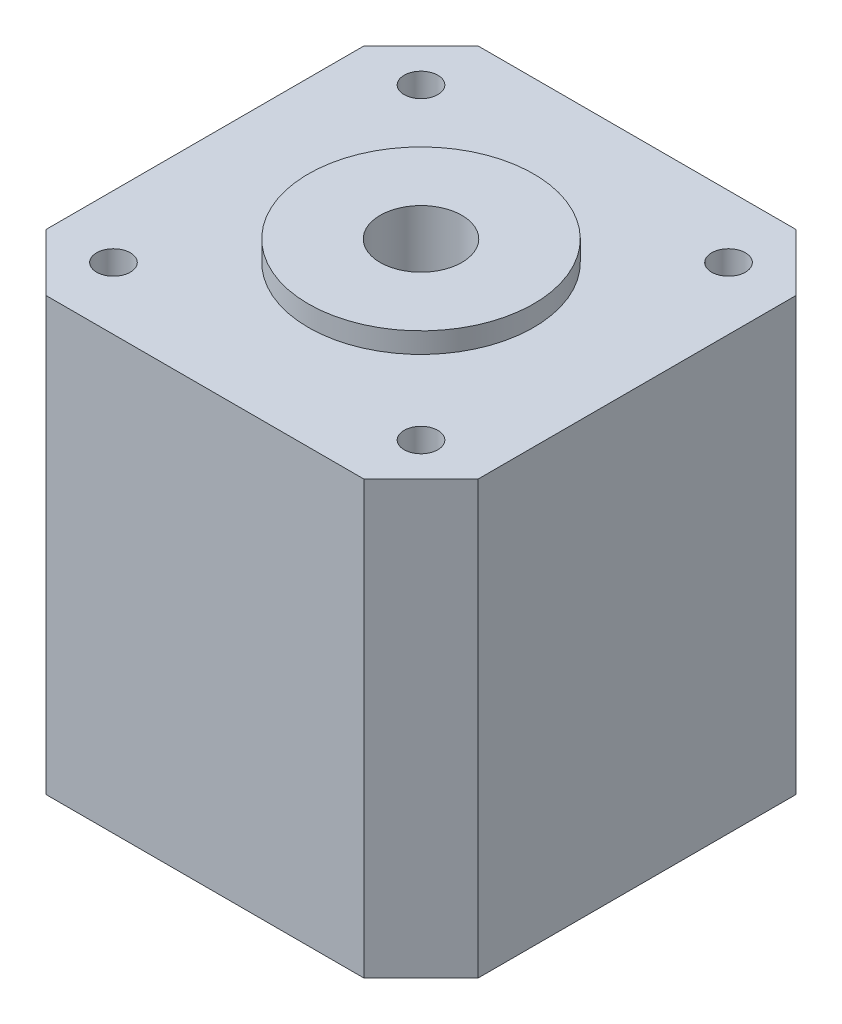
ISO-10303-21;
HEADER;
FILE_DESCRIPTION(('STEP AP214'),'2;1');
FILE_NAME('part.step','',(''),(''),'','','');
FILE_SCHEMA(('AUTOMOTIVE_DESIGN { 1 0 10303 214 1 1 1 1 }'));
ENDSEC;
DATA;
#1=APPLICATION_CONTEXT('core data for automotive mechanical design processes');
#2=APPLICATION_PROTOCOL_DEFINITION('international standard','automotive_design',2000,#1);
#3=PRODUCT_CONTEXT('',#1,'mechanical');
#4=PRODUCT('Part','Part','',(#3));
#5=PRODUCT_RELATED_PRODUCT_CATEGORY('part','',(#4));
#6=PRODUCT_DEFINITION_FORMATION('','',#4);
#7=PRODUCT_DEFINITION_CONTEXT('part definition',#1,'design');
#8=PRODUCT_DEFINITION('design','',#6,#7);
#9=PRODUCT_DEFINITION_SHAPE('','',#8);
#10=(LENGTH_UNIT() NAMED_UNIT(*) SI_UNIT(.MILLI.,.METRE.));
#11=(NAMED_UNIT(*) PLANE_ANGLE_UNIT() SI_UNIT($,.RADIAN.));
#12=(NAMED_UNIT(*) SI_UNIT($,.STERADIAN.) SOLID_ANGLE_UNIT());
#13=UNCERTAINTY_MEASURE_WITH_UNIT(LENGTH_MEASURE(1.E-05),#10,'distance_accuracy_value','');
#14=(GEOMETRIC_REPRESENTATION_CONTEXT(3) GLOBAL_UNCERTAINTY_ASSIGNED_CONTEXT((#13)) GLOBAL_UNIT_ASSIGNED_CONTEXT((#10,
#11,#12)) REPRESENTATION_CONTEXT('',''));
#15=CARTESIAN_POINT('',(0.,0.,0.));
#16=DIRECTION('',(0.,0.,1.));
#17=DIRECTION('',(1.,0.,0.));
#18=AXIS2_PLACEMENT_3D('',#15,#16,#17);
#19=CARTESIAN_POINT('',(21.15,21.15,-21.15));
#20=DIRECTION('',(-1.,0.,0.));
#21=DIRECTION('',(0.,0.,1.));
#22=AXIS2_PLACEMENT_3D('',#19,#20,#21);
#23=PLANE('',#22);
#24=DIRECTION('',(0.,0.,-1.));
#25=VECTOR('',#24,1.);
#26=CARTESIAN_POINT('',(21.15,-21.15,-21.15));
#27=LINE('',#26,#25);
#28=CARTESIAN_POINT('',(21.15,-21.15,15.55));
#29=VERTEX_POINT('',#28);
#30=CARTESIAN_POINT('',(21.15,-21.15,-15.55));
#31=VERTEX_POINT('',#30);
#32=EDGE_CURVE('E133',#29,#31,#27,.T.);
#33=ORIENTED_EDGE('',*,*,#32,.T.);
#34=DIRECTION('',(0.,1.,0.));
#35=VECTOR('',#34,1.);
#36=CARTESIAN_POINT('',(21.15,21.15,-15.55));
#37=LINE('',#36,#35);
#38=CARTESIAN_POINT('',(21.15,21.15,-15.55));
#39=VERTEX_POINT('',#38);
#40=EDGE_CURVE('E155',#31,#39,#37,.T.);
#41=ORIENTED_EDGE('',*,*,#40,.T.);
#42=DIRECTION('',(0.,0.,-1.));
#43=VECTOR('',#42,1.);
#44=CARTESIAN_POINT('',(21.15,21.15,-21.15));
#45=LINE('',#44,#43);
#46=CARTESIAN_POINT('',(21.15,21.15,15.55));
#47=VERTEX_POINT('',#46);
#48=EDGE_CURVE('E131',#47,#39,#45,.T.);
#49=ORIENTED_EDGE('',*,*,#48,.F.);
#50=DIRECTION('',(0.,-1.,0.));
#51=VECTOR('',#50,1.);
#52=CARTESIAN_POINT('',(21.15,21.15,15.55));
#53=LINE('',#52,#51);
#54=EDGE_CURVE('E152',#47,#29,#53,.T.);
#55=ORIENTED_EDGE('',*,*,#54,.T.);
#56=EDGE_LOOP('',(#33,#41,#49,#55));
#57=FACE_BOUND('',#56,.T.);
#58=ADVANCED_FACE('F36',(#57),#23,.F.);
#59=CARTESIAN_POINT('',(-21.15,21.15,-21.15));
#60=DIRECTION('',(0.,0.,1.));
#61=DIRECTION('',(1.,0.,0.));
#62=AXIS2_PLACEMENT_3D('',#59,#60,#61);
#63=PLANE('',#62);
#64=DIRECTION('',(-1.,0.,0.));
#65=VECTOR('',#64,1.);
#66=CARTESIAN_POINT('',(-21.15,-21.15,-21.15));
#67=LINE('',#66,#65);
#68=CARTESIAN_POINT('',(15.55,-21.15,-21.15));
#69=VERTEX_POINT('',#68);
#70=CARTESIAN_POINT('',(-15.55,-21.15,-21.15));
#71=VERTEX_POINT('',#70);
#72=EDGE_CURVE('E129',#69,#71,#67,.T.);
#73=ORIENTED_EDGE('',*,*,#72,.T.);
#74=DIRECTION('',(0.,1.,0.));
#75=VECTOR('',#74,1.);
#76=CARTESIAN_POINT('',(-15.55,21.15,-21.15));
#77=LINE('',#76,#75);
#78=CARTESIAN_POINT('',(-15.55,21.15,-21.15));
#79=VERTEX_POINT('',#78);
#80=EDGE_CURVE('E107',#71,#79,#77,.T.);
#81=ORIENTED_EDGE('',*,*,#80,.T.);
#82=DIRECTION('',(-1.,0.,0.));
#83=VECTOR('',#82,1.);
#84=CARTESIAN_POINT('',(-21.15,21.15,-21.15));
#85=LINE('',#84,#83);
#86=CARTESIAN_POINT('',(15.55,21.15,-21.15));
#87=VERTEX_POINT('',#86);
#88=EDGE_CURVE('E169',#87,#79,#85,.T.);
#89=ORIENTED_EDGE('',*,*,#88,.F.);
#90=DIRECTION('',(0.,-1.,0.));
#91=VECTOR('',#90,1.);
#92=CARTESIAN_POINT('',(15.55,21.15,-21.15));
#93=LINE('',#92,#91);
#94=EDGE_CURVE('E112',#87,#69,#93,.T.);
#95=ORIENTED_EDGE('',*,*,#94,.T.);
#96=EDGE_LOOP('',(#73,#81,#89,#95));
#97=FACE_BOUND('',#96,.T.);
#98=ADVANCED_FACE('F174',(#97),#63,.F.);
#99=CARTESIAN_POINT('',(-21.15,21.15,-21.15));
#100=DIRECTION('',(1.,0.,0.));
#101=DIRECTION('',(0.,0.,-1.));
#102=AXIS2_PLACEMENT_3D('',#99,#100,#101);
#103=PLANE('',#102);
#104=DIRECTION('',(0.,0.,1.));
#105=VECTOR('',#104,1.);
#106=CARTESIAN_POINT('',(-21.15,21.15,-21.15));
#107=LINE('',#106,#105);
#108=CARTESIAN_POINT('',(-21.15,21.15,-15.55));
#109=VERTEX_POINT('',#108);
#110=CARTESIAN_POINT('',(-21.15,21.15,15.55));
#111=VERTEX_POINT('',#110);
#112=EDGE_CURVE('E121',#109,#111,#107,.T.);
#113=ORIENTED_EDGE('',*,*,#112,.F.);
#114=DIRECTION('',(0.,-1.,0.));
#115=VECTOR('',#114,1.);
#116=CARTESIAN_POINT('',(-21.15,21.15,-15.55));
#117=LINE('',#116,#115);
#118=CARTESIAN_POINT('',(-21.15,-21.15,-15.55));
#119=VERTEX_POINT('',#118);
#120=EDGE_CURVE('E106',#109,#119,#117,.T.);
#121=ORIENTED_EDGE('',*,*,#120,.T.);
#122=DIRECTION('',(0.,0.,1.));
#123=VECTOR('',#122,1.);
#124=CARTESIAN_POINT('',(-21.15,-21.15,-21.15));
#125=LINE('',#124,#123);
#126=CARTESIAN_POINT('',(-21.15,-21.15,15.55));
#127=VERTEX_POINT('',#126);
#128=EDGE_CURVE('E119',#119,#127,#125,.T.);
#129=ORIENTED_EDGE('',*,*,#128,.T.);
#130=DIRECTION('',(0.,1.,0.));
#131=VECTOR('',#130,1.);
#132=CARTESIAN_POINT('',(-21.15,21.15,15.55));
#133=LINE('',#132,#131);
#134=EDGE_CURVE('E123',#127,#111,#133,.T.);
#135=ORIENTED_EDGE('',*,*,#134,.T.);
#136=EDGE_LOOP('',(#113,#121,#129,#135));
#137=FACE_BOUND('',#136,.T.);
#138=ADVANCED_FACE('F118',(#137),#103,.F.);
#139=CARTESIAN_POINT('',(-21.15,21.15,21.15));
#140=DIRECTION('',(0.,0.,-1.));
#141=DIRECTION('',(-1.,0.,0.));
#142=AXIS2_PLACEMENT_3D('',#139,#140,#141);
#143=PLANE('',#142);
#144=DIRECTION('',(1.,0.,0.));
#145=VECTOR('',#144,1.);
#146=CARTESIAN_POINT('',(-21.15,21.15,21.15));
#147=LINE('',#146,#145);
#148=CARTESIAN_POINT('',(-15.55,21.15,21.15));
#149=VERTEX_POINT('',#148);
#150=CARTESIAN_POINT('',(15.55,21.15,21.15));
#151=VERTEX_POINT('',#150);
#152=EDGE_CURVE('E180',#149,#151,#147,.T.);
#153=ORIENTED_EDGE('',*,*,#152,.F.);
#154=DIRECTION('',(0.,-1.,0.));
#155=VECTOR('',#154,1.);
#156=CARTESIAN_POINT('',(-15.55,21.15,21.15));
#157=LINE('',#156,#155);
#158=CARTESIAN_POINT('',(-15.55,-21.15,21.15));
#159=VERTEX_POINT('',#158);
#160=EDGE_CURVE('E11',#149,#159,#157,.T.);
#161=ORIENTED_EDGE('',*,*,#160,.T.);
#162=DIRECTION('',(1.,0.,0.));
#163=VECTOR('',#162,1.);
#164=CARTESIAN_POINT('',(-21.15,-21.15,21.15));
#165=LINE('',#164,#163);
#166=CARTESIAN_POINT('',(15.55,-21.15,21.15));
#167=VERTEX_POINT('',#166);
#168=EDGE_CURVE('E128',#159,#167,#165,.T.);
#169=ORIENTED_EDGE('',*,*,#168,.T.);
#170=DIRECTION('',(0.,1.,0.));
#171=VECTOR('',#170,1.);
#172=CARTESIAN_POINT('',(15.55,21.15,21.15));
#173=LINE('',#172,#171);
#174=EDGE_CURVE('E44',#167,#151,#173,.T.);
#175=ORIENTED_EDGE('',*,*,#174,.T.);
#176=EDGE_LOOP('',(#153,#161,#169,#175));
#177=FACE_BOUND('',#176,.T.);
#178=ADVANCED_FACE('F232',(#177),#143,.F.);
#179=CARTESIAN_POINT('',(0.,21.15,0.));
#180=DIRECTION('',(0.,1.,0.));
#181=DIRECTION('',(0.,0.,1.));
#182=AXIS2_PLACEMENT_3D('',#179,#180,#181);
#183=PLANE('',#182);
#184=CARTESIAN_POINT('',(-15.05,21.15,15.05));
#185=DIRECTION('',(0.,1.,0.));
#186=DIRECTION('',(0.,0.,1.));
#187=AXIS2_PLACEMENT_3D('',#184,#185,#186);
#188=CIRCLE('',#187,1.65);
#189=CARTESIAN_POINT('',(-15.05,21.15,16.7));
#190=VERTEX_POINT('',#189);
#191=EDGE_CURVE('E192',#190,#190,#188,.T.);
#192=ORIENTED_EDGE('',*,*,#191,.F.);
#193=EDGE_LOOP('',(#192));
#194=FACE_BOUND('',#193,.T.);
#195=CARTESIAN_POINT('',(15.05,21.15,15.05));
#196=DIRECTION('',(0.,1.,0.));
#197=DIRECTION('',(0.,0.,1.));
#198=AXIS2_PLACEMENT_3D('',#195,#196,#197);
#199=CIRCLE('',#198,1.65);
#200=CARTESIAN_POINT('',(15.05,21.15,16.7));
#201=VERTEX_POINT('',#200);
#202=EDGE_CURVE('E199',#201,#201,#199,.T.);
#203=ORIENTED_EDGE('',*,*,#202,.F.);
#204=EDGE_LOOP('',(#203));
#205=FACE_BOUND('',#204,.T.);
#206=CARTESIAN_POINT('',(15.05,21.15,-15.05));
#207=DIRECTION('',(0.,1.,0.));
#208=DIRECTION('',(0.,0.,1.));
#209=AXIS2_PLACEMENT_3D('',#206,#207,#208);
#210=CIRCLE('',#209,1.65);
#211=CARTESIAN_POINT('',(15.05,21.15,-13.4));
#212=VERTEX_POINT('',#211);
#213=EDGE_CURVE('E205',#212,#212,#210,.T.);
#214=ORIENTED_EDGE('',*,*,#213,.F.);
#215=EDGE_LOOP('',(#214));
#216=FACE_BOUND('',#215,.T.);
#217=CARTESIAN_POINT('',(-15.05,21.15,-15.05));
#218=DIRECTION('',(0.,1.,0.));
#219=DIRECTION('',(0.,0.,1.));
#220=AXIS2_PLACEMENT_3D('',#217,#218,#219);
#221=CIRCLE('',#220,1.65);
#222=CARTESIAN_POINT('',(-15.05,21.15,-13.4));
#223=VERTEX_POINT('',#222);
#224=EDGE_CURVE('E186',#223,#223,#221,.T.);
#225=ORIENTED_EDGE('',*,*,#224,.F.);
#226=EDGE_LOOP('',(#225));
#227=FACE_BOUND('',#226,.T.);
#228=CARTESIAN_POINT('',(0.,21.15,0.));
#229=DIRECTION('',(0.,1.,0.));
#230=DIRECTION('',(0.,0.,1.));
#231=AXIS2_PLACEMENT_3D('',#228,#229,#230);
#232=CIRCLE('',#231,11.025);
#233=CARTESIAN_POINT('',(0.,21.15,11.025));
#234=VERTEX_POINT('',#233);
#235=EDGE_CURVE('E137',#234,#234,#232,.T.);
#236=ORIENTED_EDGE('',*,*,#235,.F.);
#237=EDGE_LOOP('',(#236));
#238=FACE_BOUND('',#237,.T.);
#239=ORIENTED_EDGE('',*,*,#88,.T.);
#240=DIRECTION('',(0.707106781186549,0.,-0.707106781186546));
#241=VECTOR('',#240,1.);
#242=CARTESIAN_POINT('',(-18.35,21.15,-18.35));
#243=LINE('',#242,#241);
#244=EDGE_CURVE('E150',#79,#109,#243,.F.);
#245=ORIENTED_EDGE('',*,*,#244,.T.);
#246=ORIENTED_EDGE('',*,*,#112,.T.);
#247=DIRECTION('',(-0.707106781186546,0.,-0.707106781186549));
#248=VECTOR('',#247,1.);
#249=CARTESIAN_POINT('',(-18.3500000000001,21.15,18.35));
#250=LINE('',#249,#248);
#251=EDGE_CURVE('E57',#111,#149,#250,.F.);
#252=ORIENTED_EDGE('',*,*,#251,.T.);
#253=ORIENTED_EDGE('',*,*,#152,.T.);
#254=DIRECTION('',(-0.707106781186549,0.,0.707106781186546));
#255=VECTOR('',#254,1.);
#256=CARTESIAN_POINT('',(18.3499999999999,21.15,18.35));
#257=LINE('',#256,#255);
#258=EDGE_CURVE('E145',#151,#47,#257,.F.);
#259=ORIENTED_EDGE('',*,*,#258,.T.);
#260=ORIENTED_EDGE('',*,*,#48,.T.);
#261=DIRECTION('',(0.707106781186547,0.,0.707106781186548));
#262=VECTOR('',#261,1.);
#263=CARTESIAN_POINT('',(18.35,21.15,-18.35));
#264=LINE('',#263,#262);
#265=EDGE_CURVE('E148',#39,#87,#264,.F.);
#266=ORIENTED_EDGE('',*,*,#265,.T.);
#267=EDGE_LOOP('',(#239,#245,#246,#252,#253,#259,#260,#266));
#268=FACE_BOUND('',#267,.T.);
#269=ADVANCED_FACE('F166',(#194,#205,#216,#227,#238,#268),#183,.T.);
#270=CARTESIAN_POINT('',(0.,-21.15,0.));
#271=DIRECTION('',(0.,1.,0.));
#272=DIRECTION('',(0.,0.,1.));
#273=AXIS2_PLACEMENT_3D('',#270,#271,#272);
#274=PLANE('',#273);
#275=CARTESIAN_POINT('',(0.,-21.15,0.));
#276=DIRECTION('',(0.,1.,0.));
#277=DIRECTION('',(0.,0.,1.));
#278=AXIS2_PLACEMENT_3D('',#275,#276,#277);
#279=CIRCLE('',#278,4.);
#280=CARTESIAN_POINT('',(0.,-21.15,4.));
#281=VERTEX_POINT('',#280);
#282=EDGE_CURVE('E196',#281,#281,#279,.T.);
#283=ORIENTED_EDGE('',*,*,#282,.T.);
#284=EDGE_LOOP('',(#283));
#285=FACE_BOUND('',#284,.T.);
#286=ORIENTED_EDGE('',*,*,#128,.F.);
#287=DIRECTION('',(-0.707106781186549,0.,0.707106781186546));
#288=VECTOR('',#287,1.);
#289=CARTESIAN_POINT('',(-21.15,-21.15,-15.55));
#290=LINE('',#289,#288);
#291=EDGE_CURVE('E102',#119,#71,#290,.F.);
#292=ORIENTED_EDGE('',*,*,#291,.T.);
#293=ORIENTED_EDGE('',*,*,#72,.F.);
#294=DIRECTION('',(-0.707106781186547,0.,-0.707106781186548));
#295=VECTOR('',#294,1.);
#296=CARTESIAN_POINT('',(15.55,-21.15,-21.15));
#297=LINE('',#296,#295);
#298=EDGE_CURVE('E113',#69,#31,#297,.F.);
#299=ORIENTED_EDGE('',*,*,#298,.T.);
#300=ORIENTED_EDGE('',*,*,#32,.F.);
#301=DIRECTION('',(0.707106781186549,0.,-0.707106781186546));
#302=VECTOR('',#301,1.);
#303=CARTESIAN_POINT('',(21.15,-21.15,15.55));
#304=LINE('',#303,#302);
#305=EDGE_CURVE('E122',#29,#167,#304,.F.);
#306=ORIENTED_EDGE('',*,*,#305,.T.);
#307=ORIENTED_EDGE('',*,*,#168,.F.);
#308=DIRECTION('',(0.707106781186546,0.,0.707106781186549));
#309=VECTOR('',#308,1.);
#310=CARTESIAN_POINT('',(-15.55,-21.15,21.15));
#311=LINE('',#310,#309);
#312=EDGE_CURVE('E127',#159,#127,#311,.F.);
#313=ORIENTED_EDGE('',*,*,#312,.T.);
#314=EDGE_LOOP('',(#286,#292,#293,#299,#300,#306,#307,#313));
#315=FACE_BOUND('',#314,.T.);
#316=ADVANCED_FACE('F125',(#285,#315),#274,.F.);
#317=CARTESIAN_POINT('',(0.,23.15,0.));
#318=DIRECTION('',(0.,-1.,0.));
#319=DIRECTION('',(0.,0.,-1.));
#320=AXIS2_PLACEMENT_3D('',#317,#318,#319);
#321=CYLINDRICAL_SURFACE('',#320,11.025);
#322=CARTESIAN_POINT('',(0.,23.15,0.));
#323=DIRECTION('',(0.,1.,0.));
#324=DIRECTION('',(0.,0.,1.));
#325=AXIS2_PLACEMENT_3D('',#322,#323,#324);
#326=CIRCLE('',#325,11.025);
#327=CARTESIAN_POINT('',(0.,23.15,11.025));
#328=VERTEX_POINT('',#327);
#329=EDGE_CURVE('E175',#328,#328,#326,.T.);
#330=ORIENTED_EDGE('',*,*,#329,.F.);
#331=EDGE_LOOP('',(#330));
#332=FACE_BOUND('',#331,.T.);
#333=ORIENTED_EDGE('',*,*,#235,.T.);
#334=EDGE_LOOP('',(#333));
#335=FACE_BOUND('',#334,.T.);
#336=ADVANCED_FACE('F222',(#332,#335),#321,.T.);
#337=CARTESIAN_POINT('',(0.,23.15,0.));
#338=DIRECTION('',(0.,1.,0.));
#339=DIRECTION('',(0.,0.,1.));
#340=AXIS2_PLACEMENT_3D('',#337,#338,#339);
#341=PLANE('',#340);
#342=CARTESIAN_POINT('',(0.,23.15,0.));
#343=DIRECTION('',(0.,1.,0.));
#344=DIRECTION('',(0.,0.,1.));
#345=AXIS2_PLACEMENT_3D('',#342,#343,#344);
#346=CIRCLE('',#345,4.);
#347=CARTESIAN_POINT('',(0.,23.15,4.));
#348=VERTEX_POINT('',#347);
#349=EDGE_CURVE('E212',#348,#348,#346,.T.);
#350=ORIENTED_EDGE('',*,*,#349,.F.);
#351=EDGE_LOOP('',(#350));
#352=FACE_BOUND('',#351,.T.);
#353=ORIENTED_EDGE('',*,*,#329,.T.);
#354=EDGE_LOOP('',(#353));
#355=FACE_BOUND('',#354,.T.);
#356=ADVANCED_FACE('F219',(#352,#355),#341,.T.);
#357=CARTESIAN_POINT('',(-21.15,21.15,-15.55));
#358=DIRECTION('',(0.707106781186546,0.,0.707106781186549));
#359=DIRECTION('',(0.,-1.,0.));
#360=AXIS2_PLACEMENT_3D('',#357,#358,#359);
#361=PLANE('',#360);
#362=ORIENTED_EDGE('',*,*,#244,.F.);
#363=ORIENTED_EDGE('',*,*,#80,.F.);
#364=ORIENTED_EDGE('',*,*,#291,.F.);
#365=ORIENTED_EDGE('',*,*,#120,.F.);
#366=EDGE_LOOP('',(#362,#363,#364,#365));
#367=FACE_BOUND('',#366,.T.);
#368=ADVANCED_FACE('F105',(#367),#361,.F.);
#369=CARTESIAN_POINT('',(15.55,21.15,-21.15));
#370=DIRECTION('',(-0.707106781186548,0.,0.707106781186547));
#371=DIRECTION('',(0.,-1.,0.));
#372=AXIS2_PLACEMENT_3D('',#369,#370,#371);
#373=PLANE('',#372);
#374=ORIENTED_EDGE('',*,*,#265,.F.);
#375=ORIENTED_EDGE('',*,*,#40,.F.);
#376=ORIENTED_EDGE('',*,*,#298,.F.);
#377=ORIENTED_EDGE('',*,*,#94,.F.);
#378=EDGE_LOOP('',(#374,#375,#376,#377));
#379=FACE_BOUND('',#378,.T.);
#380=ADVANCED_FACE('F172',(#379),#373,.F.);
#381=CARTESIAN_POINT('',(-15.55,21.15,21.15));
#382=DIRECTION('',(0.707106781186549,0.,-0.707106781186546));
#383=DIRECTION('',(0.,-1.,0.));
#384=AXIS2_PLACEMENT_3D('',#381,#382,#383);
#385=PLANE('',#384);
#386=ORIENTED_EDGE('',*,*,#251,.F.);
#387=ORIENTED_EDGE('',*,*,#134,.F.);
#388=ORIENTED_EDGE('',*,*,#312,.F.);
#389=ORIENTED_EDGE('',*,*,#160,.F.);
#390=EDGE_LOOP('',(#386,#387,#388,#389));
#391=FACE_BOUND('',#390,.T.);
#392=ADVANCED_FACE('F257',(#391),#385,.F.);
#393=CARTESIAN_POINT('',(21.15,21.15,15.55));
#394=DIRECTION('',(-0.707106781186546,0.,-0.707106781186549));
#395=DIRECTION('',(0.,-1.,0.));
#396=AXIS2_PLACEMENT_3D('',#393,#394,#395);
#397=PLANE('',#396);
#398=ORIENTED_EDGE('',*,*,#258,.F.);
#399=ORIENTED_EDGE('',*,*,#174,.F.);
#400=ORIENTED_EDGE('',*,*,#305,.F.);
#401=ORIENTED_EDGE('',*,*,#54,.F.);
#402=EDGE_LOOP('',(#398,#399,#400,#401));
#403=FACE_BOUND('',#402,.T.);
#404=ADVANCED_FACE('F38',(#403),#397,.F.);
#405=CARTESIAN_POINT('',(-15.05,11.15,-15.05));
#406=DIRECTION('',(0.,1.,0.));
#407=DIRECTION('',(0.,0.,1.));
#408=AXIS2_PLACEMENT_3D('',#405,#406,#407);
#409=CYLINDRICAL_SURFACE('',#408,1.65);
#410=CARTESIAN_POINT('',(-15.05,11.15,-15.05));
#411=DIRECTION('',(0.,1.,0.));
#412=DIRECTION('',(0.,0.,1.));
#413=AXIS2_PLACEMENT_3D('',#410,#411,#412);
#414=CIRCLE('',#413,1.65);
#415=CARTESIAN_POINT('',(-15.05,11.15,-13.4));
#416=VERTEX_POINT('',#415);
#417=EDGE_CURVE('E177',#416,#416,#414,.T.);
#418=ORIENTED_EDGE('',*,*,#417,.F.);
#419=EDGE_LOOP('',(#418));
#420=FACE_BOUND('',#419,.T.);
#421=ORIENTED_EDGE('',*,*,#224,.T.);
#422=EDGE_LOOP('',(#421));
#423=FACE_BOUND('',#422,.T.);
#424=ADVANCED_FACE('F265',(#420,#423),#409,.F.);
#425=CARTESIAN_POINT('',(-15.05,11.15,-15.05));
#426=DIRECTION('',(0.,1.,0.));
#427=DIRECTION('',(0.,0.,1.));
#428=AXIS2_PLACEMENT_3D('',#425,#426,#427);
#429=PLANE('',#428);
#430=ORIENTED_EDGE('',*,*,#417,.T.);
#431=EDGE_LOOP('',(#430));
#432=FACE_BOUND('',#431,.T.);
#433=ADVANCED_FACE('F270',(#432),#429,.T.);
#434=CARTESIAN_POINT('',(15.05,11.15,-15.05));
#435=DIRECTION('',(0.,1.,0.));
#436=DIRECTION('',(0.,0.,1.));
#437=AXIS2_PLACEMENT_3D('',#434,#435,#436);
#438=CYLINDRICAL_SURFACE('',#437,1.65);
#439=CARTESIAN_POINT('',(15.05,11.15,-15.05));
#440=DIRECTION('',(0.,1.,0.));
#441=DIRECTION('',(0.,0.,1.));
#442=AXIS2_PLACEMENT_3D('',#439,#440,#441);
#443=CIRCLE('',#442,1.65);
#444=CARTESIAN_POINT('',(15.05,11.15,-13.4));
#445=VERTEX_POINT('',#444);
#446=EDGE_CURVE('E189',#445,#445,#443,.T.);
#447=ORIENTED_EDGE('',*,*,#446,.F.);
#448=EDGE_LOOP('',(#447));
#449=FACE_BOUND('',#448,.T.);
#450=ORIENTED_EDGE('',*,*,#213,.T.);
#451=EDGE_LOOP('',(#450));
#452=FACE_BOUND('',#451,.T.);
#453=ADVANCED_FACE('F276',(#449,#452),#438,.F.);
#454=CARTESIAN_POINT('',(15.05,11.15,-15.05));
#455=DIRECTION('',(0.,1.,0.));
#456=DIRECTION('',(0.,0.,1.));
#457=AXIS2_PLACEMENT_3D('',#454,#455,#456);
#458=PLANE('',#457);
#459=ORIENTED_EDGE('',*,*,#446,.T.);
#460=EDGE_LOOP('',(#459));
#461=FACE_BOUND('',#460,.T.);
#462=ADVANCED_FACE('F294',(#461),#458,.T.);
#463=CARTESIAN_POINT('',(15.05,11.15,15.05));
#464=DIRECTION('',(0.,1.,0.));
#465=DIRECTION('',(0.,0.,1.));
#466=AXIS2_PLACEMENT_3D('',#463,#464,#465);
#467=CYLINDRICAL_SURFACE('',#466,1.65);
#468=CARTESIAN_POINT('',(15.05,11.15,15.05));
#469=DIRECTION('',(0.,1.,0.));
#470=DIRECTION('',(0.,0.,1.));
#471=AXIS2_PLACEMENT_3D('',#468,#469,#470);
#472=CIRCLE('',#471,1.65);
#473=CARTESIAN_POINT('',(15.05,11.15,16.7));
#474=VERTEX_POINT('',#473);
#475=EDGE_CURVE('E202',#474,#474,#472,.T.);
#476=ORIENTED_EDGE('',*,*,#475,.F.);
#477=EDGE_LOOP('',(#476));
#478=FACE_BOUND('',#477,.T.);
#479=ORIENTED_EDGE('',*,*,#202,.T.);
#480=EDGE_LOOP('',(#479));
#481=FACE_BOUND('',#480,.T.);
#482=ADVANCED_FACE('F291',(#478,#481),#467,.F.);
#483=CARTESIAN_POINT('',(15.05,11.15,15.05));
#484=DIRECTION('',(0.,1.,0.));
#485=DIRECTION('',(0.,0.,1.));
#486=AXIS2_PLACEMENT_3D('',#483,#484,#485);
#487=PLANE('',#486);
#488=ORIENTED_EDGE('',*,*,#475,.T.);
#489=EDGE_LOOP('',(#488));
#490=FACE_BOUND('',#489,.T.);
#491=ADVANCED_FACE('F286',(#490),#487,.T.);
#492=CARTESIAN_POINT('',(-15.05,11.15,15.05));
#493=DIRECTION('',(0.,1.,0.));
#494=DIRECTION('',(0.,0.,1.));
#495=AXIS2_PLACEMENT_3D('',#492,#493,#494);
#496=CYLINDRICAL_SURFACE('',#495,1.65);
#497=CARTESIAN_POINT('',(-15.05,11.15,15.05));
#498=DIRECTION('',(0.,1.,0.));
#499=DIRECTION('',(0.,0.,1.));
#500=AXIS2_PLACEMENT_3D('',#497,#498,#499);
#501=CIRCLE('',#500,1.65);
#502=CARTESIAN_POINT('',(-15.05,11.15,16.7));
#503=VERTEX_POINT('',#502);
#504=EDGE_CURVE('E195',#503,#503,#501,.T.);
#505=ORIENTED_EDGE('',*,*,#504,.F.);
#506=EDGE_LOOP('',(#505));
#507=FACE_BOUND('',#506,.T.);
#508=ORIENTED_EDGE('',*,*,#191,.T.);
#509=EDGE_LOOP('',(#508));
#510=FACE_BOUND('',#509,.T.);
#511=ADVANCED_FACE('F282',(#507,#510),#496,.F.);
#512=CARTESIAN_POINT('',(-15.05,11.15,15.05));
#513=DIRECTION('',(0.,1.,0.));
#514=DIRECTION('',(0.,0.,1.));
#515=AXIS2_PLACEMENT_3D('',#512,#513,#514);
#516=PLANE('',#515);
#517=ORIENTED_EDGE('',*,*,#504,.T.);
#518=EDGE_LOOP('',(#517));
#519=FACE_BOUND('',#518,.T.);
#520=ADVANCED_FACE('F285',(#519),#516,.T.);
#521=CARTESIAN_POINT('',(0.,-46.85,0.));
#522=DIRECTION('',(0.,1.,0.));
#523=DIRECTION('',(0.,0.,1.));
#524=AXIS2_PLACEMENT_3D('',#521,#522,#523);
#525=CYLINDRICAL_SURFACE('',#524,4.);
#526=ORIENTED_EDGE('',*,*,#349,.T.);
#527=EDGE_LOOP('',(#526));
#528=FACE_BOUND('',#527,.T.);
#529=ORIENTED_EDGE('',*,*,#282,.F.);
#530=EDGE_LOOP('',(#529));
#531=FACE_BOUND('',#530,.T.);
#532=ADVANCED_FACE('F216',(#528,#531),#525,.F.);
#533=CLOSED_SHELL('',(#58,#98,#138,#178,#269,#316,#336,#356,#368,#380,#392,#404,#424,#433,#453,
#462,#482,#491,#511,#520,#532));
#534=MANIFOLD_SOLID_BREP('B2',#533);
#535=ADVANCED_BREP_SHAPE_REPRESENTATION('',(#18,#534),#14);
#536=SHAPE_DEFINITION_REPRESENTATION(#9,#535);
ENDSEC;
END-ISO-10303-21;
